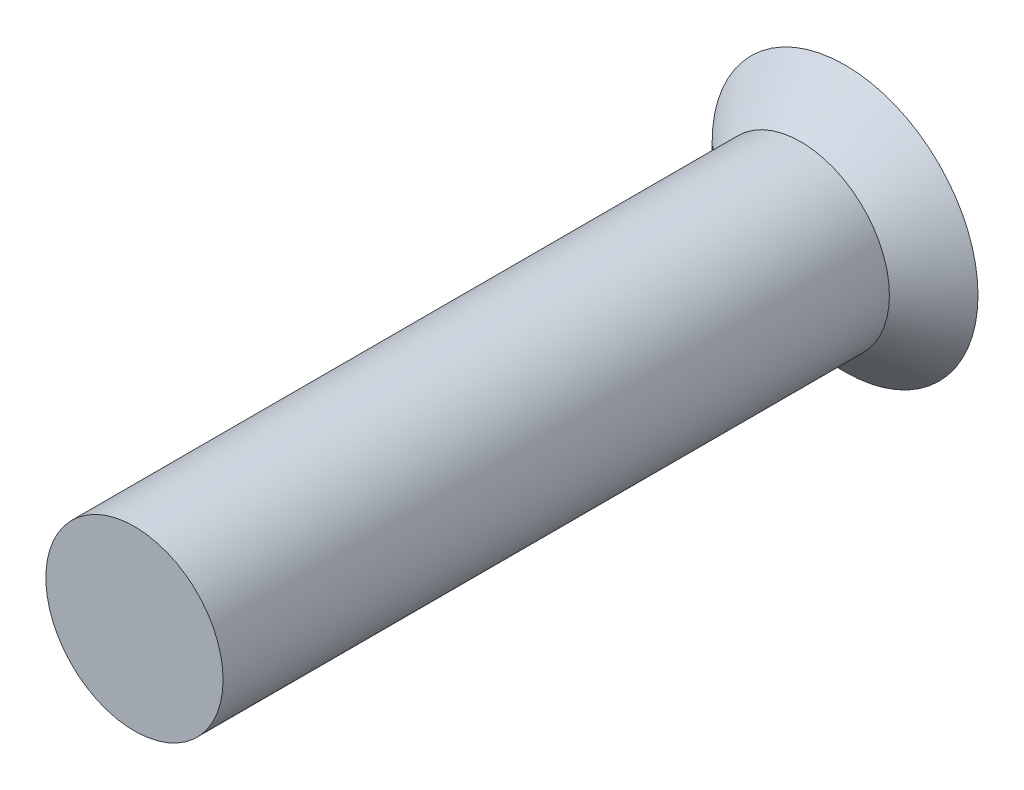
ISO-10303-21;
HEADER;
FILE_DESCRIPTION(('STEP AP214'),'2;1');
FILE_NAME('part.step','',(''),(''),'','','');
FILE_SCHEMA(('AUTOMOTIVE_DESIGN { 1 0 10303 214 1 1 1 1 }'));
ENDSEC;
DATA;
#1=APPLICATION_CONTEXT('core data for automotive mechanical design processes');
#2=APPLICATION_PROTOCOL_DEFINITION('international standard','automotive_design',2000,#1);
#3=PRODUCT_CONTEXT('',#1,'mechanical');
#4=PRODUCT('Part','Part','',(#3));
#5=PRODUCT_RELATED_PRODUCT_CATEGORY('part','',(#4));
#6=PRODUCT_DEFINITION_FORMATION('','',#4);
#7=PRODUCT_DEFINITION_CONTEXT('part definition',#1,'design');
#8=PRODUCT_DEFINITION('design','',#6,#7);
#9=PRODUCT_DEFINITION_SHAPE('','',#8);
#10=(LENGTH_UNIT() NAMED_UNIT(*) SI_UNIT(.MILLI.,.METRE.));
#11=(NAMED_UNIT(*) PLANE_ANGLE_UNIT() SI_UNIT($,.RADIAN.));
#12=(NAMED_UNIT(*) SI_UNIT($,.STERADIAN.) SOLID_ANGLE_UNIT());
#13=UNCERTAINTY_MEASURE_WITH_UNIT(LENGTH_MEASURE(1.E-05),#10,'distance_accuracy_value','');
#14=(GEOMETRIC_REPRESENTATION_CONTEXT(3) GLOBAL_UNCERTAINTY_ASSIGNED_CONTEXT((#13)) GLOBAL_UNIT_ASSIGNED_CONTEXT((#10,
#11,#12)) REPRESENTATION_CONTEXT('',''));
#15=CARTESIAN_POINT('',(0.,0.,0.));
#16=DIRECTION('',(0.,0.,1.));
#17=DIRECTION('',(1.,0.,0.));
#18=AXIS2_PLACEMENT_3D('',#15,#16,#17);
#19=CARTESIAN_POINT('',(0.,0.,1.88));
#20=DIRECTION('',(0.,0.,-1.));
#21=DIRECTION('',(-1.,0.,0.));
#22=AXIS2_PLACEMENT_3D('',#19,#20,#21);
#23=CYLINDRICAL_SURFACE('',#22,0.5);
#24=CARTESIAN_POINT('',(0.,0.,1.88));
#25=DIRECTION('',(0.,0.,1.));
#26=DIRECTION('',(1.,0.,0.));
#27=AXIS2_PLACEMENT_3D('',#24,#25,#26);
#28=CIRCLE('',#27,0.5);
#29=CARTESIAN_POINT('',(0.5,0.,1.88));
#30=VERTEX_POINT('',#29);
#31=EDGE_CURVE('E11',#30,#30,#28,.T.);
#32=ORIENTED_EDGE('',*,*,#31,.F.);
#33=EDGE_LOOP('',(#32));
#34=FACE_BOUND('',#33,.T.);
#35=CARTESIAN_POINT('',(0.,0.,-1.88));
#36=DIRECTION('',(0.,0.,1.));
#37=DIRECTION('',(1.,0.,0.));
#38=AXIS2_PLACEMENT_3D('',#35,#36,#37);
#39=CIRCLE('',#38,0.5);
#40=CARTESIAN_POINT('',(0.5,0.,-1.88));
#41=VERTEX_POINT('',#40);
#42=EDGE_CURVE('E189',#41,#41,#39,.T.);
#43=ORIENTED_EDGE('',*,*,#42,.T.);
#44=EDGE_LOOP('',(#43));
#45=FACE_BOUND('',#44,.T.);
#46=ADVANCED_FACE('F34',(#34,#45),#23,.T.);
#47=CARTESIAN_POINT('',(0.,0.,1.88));
#48=DIRECTION('',(0.,0.,1.));
#49=DIRECTION('',(1.,0.,0.));
#50=AXIS2_PLACEMENT_3D('',#47,#48,#49);
#51=PLANE('',#50);
#52=ORIENTED_EDGE('',*,*,#31,.T.);
#53=EDGE_LOOP('',(#52));
#54=FACE_BOUND('',#53,.T.);
#55=ADVANCED_FACE('F215',(#54),#51,.T.);
#56=CARTESIAN_POINT('',(0.,0.750000000000001,-2.13));
#57=DIRECTION('',(0.,0.,1.));
#58=DIRECTION('',(1.,0.,0.));
#59=AXIS2_PLACEMENT_3D('',#56,#57,#58);
#60=PLANE('',#59);
#61=DIRECTION('',(0.,-1.,0.));
#62=VECTOR('',#61,1.);
#63=CARTESIAN_POINT('',(0.1,0.6,-2.13));
#64=LINE('',#63,#62);
#65=CARTESIAN_POINT('',(0.1,0.6,-2.13));
#66=VERTEX_POINT('',#65);
#67=CARTESIAN_POINT('',(0.1,0.1,-2.13));
#68=VERTEX_POINT('',#67);
#69=EDGE_CURVE('E158',#66,#68,#64,.T.);
#70=ORIENTED_EDGE('',*,*,#69,.F.);
#71=DIRECTION('',(1.,0.,0.));
#72=VECTOR('',#71,1.);
#73=CARTESIAN_POINT('',(-0.1,0.6,-2.13));
#74=LINE('',#73,#72);
#75=CARTESIAN_POINT('',(-0.1,0.6,-2.13));
#76=VERTEX_POINT('',#75);
#77=EDGE_CURVE('E48',#76,#66,#74,.T.);
#78=ORIENTED_EDGE('',*,*,#77,.F.);
#79=DIRECTION('',(0.,1.,0.));
#80=VECTOR('',#79,1.);
#81=CARTESIAN_POINT('',(-0.1,0.1,-2.13));
#82=LINE('',#81,#80);
#83=CARTESIAN_POINT('',(-0.1,0.1,-2.13));
#84=VERTEX_POINT('',#83);
#85=EDGE_CURVE('E185',#84,#76,#82,.T.);
#86=ORIENTED_EDGE('',*,*,#85,.F.);
#87=DIRECTION('',(1.,0.,0.));
#88=VECTOR('',#87,1.);
#89=CARTESIAN_POINT('',(-0.6,0.1,-2.13));
#90=LINE('',#89,#88);
#91=CARTESIAN_POINT('',(-0.6,0.1,-2.13));
#92=VERTEX_POINT('',#91);
#93=EDGE_CURVE('E183',#92,#84,#90,.T.);
#94=ORIENTED_EDGE('',*,*,#93,.F.);
#95=DIRECTION('',(0.,1.,0.));
#96=VECTOR('',#95,1.);
#97=CARTESIAN_POINT('',(-0.6,-0.1,-2.13));
#98=LINE('',#97,#96);
#99=CARTESIAN_POINT('',(-0.6,-0.1,-2.13));
#100=VERTEX_POINT('',#99);
#101=EDGE_CURVE('E132',#100,#92,#98,.T.);
#102=ORIENTED_EDGE('',*,*,#101,.F.);
#103=DIRECTION('',(-1.,0.,0.));
#104=VECTOR('',#103,1.);
#105=CARTESIAN_POINT('',(-0.0999999999999999,-0.1,-2.13));
#106=LINE('',#105,#104);
#107=CARTESIAN_POINT('',(-0.0999999999999999,-0.1,-2.13));
#108=VERTEX_POINT('',#107);
#109=EDGE_CURVE('E179',#108,#100,#106,.T.);
#110=ORIENTED_EDGE('',*,*,#109,.F.);
#111=DIRECTION('',(0.,1.,0.));
#112=VECTOR('',#111,1.);
#113=CARTESIAN_POINT('',(-0.1,-0.6,-2.13));
#114=LINE('',#113,#112);
#115=CARTESIAN_POINT('',(-0.1,-0.6,-2.13));
#116=VERTEX_POINT('',#115);
#117=EDGE_CURVE('E176',#116,#108,#114,.T.);
#118=ORIENTED_EDGE('',*,*,#117,.F.);
#119=DIRECTION('',(-1.,0.,0.));
#120=VECTOR('',#119,1.);
#121=CARTESIAN_POINT('',(0.0999999999999999,-0.6,-2.13));
#122=LINE('',#121,#120);
#123=CARTESIAN_POINT('',(0.0999999999999999,-0.6,-2.13));
#124=VERTEX_POINT('',#123);
#125=EDGE_CURVE('E173',#124,#116,#122,.T.);
#126=ORIENTED_EDGE('',*,*,#125,.F.);
#127=DIRECTION('',(0.,-1.,0.));
#128=VECTOR('',#127,1.);
#129=CARTESIAN_POINT('',(0.1,-0.1,-2.13));
#130=LINE('',#129,#128);
#131=CARTESIAN_POINT('',(0.1,-0.1,-2.13));
#132=VERTEX_POINT('',#131);
#133=EDGE_CURVE('E170',#132,#124,#130,.T.);
#134=ORIENTED_EDGE('',*,*,#133,.F.);
#135=DIRECTION('',(-1.,0.,0.));
#136=VECTOR('',#135,1.);
#137=CARTESIAN_POINT('',(0.6,-0.1,-2.13));
#138=LINE('',#137,#136);
#139=CARTESIAN_POINT('',(0.6,-0.1,-2.13));
#140=VERTEX_POINT('',#139);
#141=EDGE_CURVE('E167',#140,#132,#138,.T.);
#142=ORIENTED_EDGE('',*,*,#141,.F.);
#143=DIRECTION('',(0.,-1.,0.));
#144=VECTOR('',#143,1.);
#145=CARTESIAN_POINT('',(0.6,0.1,-2.13));
#146=LINE('',#145,#144);
#147=CARTESIAN_POINT('',(0.6,0.1,-2.13));
#148=VERTEX_POINT('',#147);
#149=EDGE_CURVE('E164',#148,#140,#146,.T.);
#150=ORIENTED_EDGE('',*,*,#149,.F.);
#151=DIRECTION('',(1.,0.,0.));
#152=VECTOR('',#151,1.);
#153=CARTESIAN_POINT('',(0.1,0.1,-2.13));
#154=LINE('',#153,#152);
#155=EDGE_CURVE('E161',#68,#148,#154,.T.);
#156=ORIENTED_EDGE('',*,*,#155,.F.);
#157=EDGE_LOOP('',(#70,#78,#86,#94,#102,#110,#118,#126,#134,#142,#150,#156));
#158=FACE_BOUND('',#157,.T.);
#159=CARTESIAN_POINT('',(0.,0.,-2.13));
#160=DIRECTION('',(0.,0.,1.));
#161=DIRECTION('',(1.,0.,0.));
#162=AXIS2_PLACEMENT_3D('',#159,#160,#161);
#163=CIRCLE('',#162,0.750000000000001);
#164=CARTESIAN_POINT('',(0.750000000000001,0.,-2.13));
#165=VERTEX_POINT('',#164);
#166=EDGE_CURVE('E41',#165,#165,#163,.T.);
#167=ORIENTED_EDGE('',*,*,#166,.F.);
#168=EDGE_LOOP('',(#167));
#169=FACE_BOUND('',#168,.T.);
#170=ADVANCED_FACE('F213',(#158,#169),#60,.F.);
#171=CARTESIAN_POINT('',(0.,0.,-2.13));
#172=DIRECTION('',(0.,0.,-1.));
#173=DIRECTION('',(-1.,0.,0.));
#174=AXIS2_PLACEMENT_3D('',#171,#172,#173);
#175=CONICAL_SURFACE('',#174,0.750000000000001,0.78539816339745);
#176=ORIENTED_EDGE('',*,*,#42,.F.);
#177=EDGE_LOOP('',(#176));
#178=FACE_BOUND('',#177,.T.);
#179=ORIENTED_EDGE('',*,*,#166,.T.);
#180=EDGE_LOOP('',(#179));
#181=FACE_BOUND('',#180,.T.);
#182=ADVANCED_FACE('F211',(#178,#181),#175,.T.);
#183=CARTESIAN_POINT('',(-0.1,0.6,-2.03));
#184=DIRECTION('',(0.,1.,0.));
#185=DIRECTION('',(0.,0.,1.));
#186=AXIS2_PLACEMENT_3D('',#183,#184,#185);
#187=PLANE('',#186);
#188=ORIENTED_EDGE('',*,*,#77,.T.);
#189=DIRECTION('',(0.,0.,-1.));
#190=VECTOR('',#189,1.);
#191=CARTESIAN_POINT('',(0.1,0.6,-2.03));
#192=LINE('',#191,#190);
#193=CARTESIAN_POINT('',(0.1,0.6,-2.03));
#194=VERTEX_POINT('',#193);
#195=EDGE_CURVE('E96',#194,#66,#192,.T.);
#196=ORIENTED_EDGE('',*,*,#195,.F.);
#197=DIRECTION('',(1.,0.,0.));
#198=VECTOR('',#197,1.);
#199=CARTESIAN_POINT('',(-0.1,0.6,-2.03));
#200=LINE('',#199,#198);
#201=CARTESIAN_POINT('',(-0.1,0.6,-2.03));
#202=VERTEX_POINT('',#201);
#203=EDGE_CURVE('E187',#202,#194,#200,.T.);
#204=ORIENTED_EDGE('',*,*,#203,.F.);
#205=DIRECTION('',(0.,0.,-1.));
#206=VECTOR('',#205,1.);
#207=CARTESIAN_POINT('',(-0.1,0.6,-2.03));
#208=LINE('',#207,#206);
#209=EDGE_CURVE('E56',#202,#76,#208,.T.);
#210=ORIENTED_EDGE('',*,*,#209,.T.);
#211=EDGE_LOOP('',(#188,#196,#204,#210));
#212=FACE_BOUND('',#211,.T.);
#213=ADVANCED_FACE('F222',(#212),#187,.F.);
#214=CARTESIAN_POINT('',(-0.1,0.1,-2.03));
#215=DIRECTION('',(-1.,0.,0.));
#216=DIRECTION('',(0.,-1.,0.));
#217=AXIS2_PLACEMENT_3D('',#214,#215,#216);
#218=PLANE('',#217);
#219=ORIENTED_EDGE('',*,*,#85,.T.);
#220=ORIENTED_EDGE('',*,*,#209,.F.);
#221=DIRECTION('',(0.,1.,0.));
#222=VECTOR('',#221,1.);
#223=CARTESIAN_POINT('',(-0.1,0.1,-2.03));
#224=LINE('',#223,#222);
#225=CARTESIAN_POINT('',(-0.1,0.1,-2.03));
#226=VERTEX_POINT('',#225);
#227=EDGE_CURVE('E144',#226,#202,#224,.T.);
#228=ORIENTED_EDGE('',*,*,#227,.F.);
#229=DIRECTION('',(0.,0.,-1.));
#230=VECTOR('',#229,1.);
#231=CARTESIAN_POINT('',(-0.1,0.1,-2.03));
#232=LINE('',#231,#230);
#233=EDGE_CURVE('E136',#226,#84,#232,.T.);
#234=ORIENTED_EDGE('',*,*,#233,.T.);
#235=EDGE_LOOP('',(#219,#220,#228,#234));
#236=FACE_BOUND('',#235,.T.);
#237=ADVANCED_FACE('F257',(#236),#218,.F.);
#238=CARTESIAN_POINT('',(-0.6,0.1,-2.03));
#239=DIRECTION('',(0.,1.,0.));
#240=DIRECTION('',(0.,0.,1.));
#241=AXIS2_PLACEMENT_3D('',#238,#239,#240);
#242=PLANE('',#241);
#243=ORIENTED_EDGE('',*,*,#93,.T.);
#244=ORIENTED_EDGE('',*,*,#233,.F.);
#245=DIRECTION('',(1.,0.,0.));
#246=VECTOR('',#245,1.);
#247=CARTESIAN_POINT('',(-0.6,0.1,-2.03));
#248=LINE('',#247,#246);
#249=CARTESIAN_POINT('',(-0.6,0.1,-2.03));
#250=VERTEX_POINT('',#249);
#251=EDGE_CURVE('E140',#250,#226,#248,.T.);
#252=ORIENTED_EDGE('',*,*,#251,.F.);
#253=DIRECTION('',(0.,0.,-1.));
#254=VECTOR('',#253,1.);
#255=CARTESIAN_POINT('',(-0.6,0.1,-2.03));
#256=LINE('',#255,#254);
#257=EDGE_CURVE('E125',#250,#92,#256,.T.);
#258=ORIENTED_EDGE('',*,*,#257,.T.);
#259=EDGE_LOOP('',(#243,#244,#252,#258));
#260=FACE_BOUND('',#259,.T.);
#261=ADVANCED_FACE('F141',(#260),#242,.F.);
#262=CARTESIAN_POINT('',(-0.6,-0.1,-2.03));
#263=DIRECTION('',(-1.,0.,0.));
#264=DIRECTION('',(0.,-1.,0.));
#265=AXIS2_PLACEMENT_3D('',#262,#263,#264);
#266=PLANE('',#265);
#267=ORIENTED_EDGE('',*,*,#101,.T.);
#268=ORIENTED_EDGE('',*,*,#257,.F.);
#269=DIRECTION('',(0.,1.,0.));
#270=VECTOR('',#269,1.);
#271=CARTESIAN_POINT('',(-0.6,-0.1,-2.03));
#272=LINE('',#271,#270);
#273=CARTESIAN_POINT('',(-0.6,-0.1,-2.03));
#274=VERTEX_POINT('',#273);
#275=EDGE_CURVE('E129',#274,#250,#272,.T.);
#276=ORIENTED_EDGE('',*,*,#275,.F.);
#277=DIRECTION('',(0.,0.,-1.));
#278=VECTOR('',#277,1.);
#279=CARTESIAN_POINT('',(-0.6,-0.1,-2.03));
#280=LINE('',#279,#278);
#281=EDGE_CURVE('E137',#274,#100,#280,.T.);
#282=ORIENTED_EDGE('',*,*,#281,.T.);
#283=EDGE_LOOP('',(#267,#268,#276,#282));
#284=FACE_BOUND('',#283,.T.);
#285=ADVANCED_FACE('F127',(#284),#266,.F.);
#286=CARTESIAN_POINT('',(-0.0999999999999999,-0.1,-2.03));
#287=DIRECTION('',(0.,-1.,0.));
#288=DIRECTION('',(0.,0.,-1.));
#289=AXIS2_PLACEMENT_3D('',#286,#287,#288);
#290=PLANE('',#289);
#291=ORIENTED_EDGE('',*,*,#109,.T.);
#292=ORIENTED_EDGE('',*,*,#281,.F.);
#293=DIRECTION('',(-1.,0.,0.));
#294=VECTOR('',#293,1.);
#295=CARTESIAN_POINT('',(-0.0999999999999999,-0.1,-2.03));
#296=LINE('',#295,#294);
#297=CARTESIAN_POINT('',(-0.0999999999999999,-0.1,-2.03));
#298=VERTEX_POINT('',#297);
#299=EDGE_CURVE('E150',#298,#274,#296,.T.);
#300=ORIENTED_EDGE('',*,*,#299,.F.);
#301=DIRECTION('',(0.,0.,-1.));
#302=VECTOR('',#301,1.);
#303=CARTESIAN_POINT('',(-0.0999999999999999,-0.1,-2.03));
#304=LINE('',#303,#302);
#305=EDGE_CURVE('E192',#298,#108,#304,.T.);
#306=ORIENTED_EDGE('',*,*,#305,.T.);
#307=EDGE_LOOP('',(#291,#292,#300,#306));
#308=FACE_BOUND('',#307,.T.);
#309=ADVANCED_FACE('F282',(#308),#290,.F.);
#310=CARTESIAN_POINT('',(-0.1,-0.6,-2.03));
#311=DIRECTION('',(-1.,0.,0.));
#312=DIRECTION('',(0.,-1.,0.));
#313=AXIS2_PLACEMENT_3D('',#310,#311,#312);
#314=PLANE('',#313);
#315=ORIENTED_EDGE('',*,*,#117,.T.);
#316=ORIENTED_EDGE('',*,*,#305,.F.);
#317=DIRECTION('',(0.,1.,0.));
#318=VECTOR('',#317,1.);
#319=CARTESIAN_POINT('',(-0.1,-0.6,-2.03));
#320=LINE('',#319,#318);
#321=CARTESIAN_POINT('',(-0.1,-0.6,-2.03));
#322=VERTEX_POINT('',#321);
#323=EDGE_CURVE('E152',#322,#298,#320,.T.);
#324=ORIENTED_EDGE('',*,*,#323,.F.);
#325=DIRECTION('',(0.,0.,-1.));
#326=VECTOR('',#325,1.);
#327=CARTESIAN_POINT('',(-0.1,-0.6,-2.03));
#328=LINE('',#327,#326);
#329=EDGE_CURVE('E194',#322,#116,#328,.T.);
#330=ORIENTED_EDGE('',*,*,#329,.T.);
#331=EDGE_LOOP('',(#315,#316,#324,#330));
#332=FACE_BOUND('',#331,.T.);
#333=ADVANCED_FACE('F291',(#332),#314,.F.);
#334=CARTESIAN_POINT('',(0.0999999999999999,-0.6,-2.03));
#335=DIRECTION('',(0.,-1.,0.));
#336=DIRECTION('',(1.,0.,0.));
#337=AXIS2_PLACEMENT_3D('',#334,#335,#336);
#338=PLANE('',#337);
#339=ORIENTED_EDGE('',*,*,#125,.T.);
#340=ORIENTED_EDGE('',*,*,#329,.F.);
#341=DIRECTION('',(-1.,0.,0.));
#342=VECTOR('',#341,1.);
#343=CARTESIAN_POINT('',(0.0999999999999999,-0.6,-2.03));
#344=LINE('',#343,#342);
#345=CARTESIAN_POINT('',(0.0999999999999999,-0.6,-2.03));
#346=VERTEX_POINT('',#345);
#347=EDGE_CURVE('E395',#346,#322,#344,.T.);
#348=ORIENTED_EDGE('',*,*,#347,.F.);
#349=DIRECTION('',(0.,0.,-1.));
#350=VECTOR('',#349,1.);
#351=CARTESIAN_POINT('',(0.0999999999999999,-0.6,-2.03));
#352=LINE('',#351,#350);
#353=EDGE_CURVE('E196',#346,#124,#352,.T.);
#354=ORIENTED_EDGE('',*,*,#353,.T.);
#355=EDGE_LOOP('',(#339,#340,#348,#354));
#356=FACE_BOUND('',#355,.T.);
#357=ADVANCED_FACE('F301',(#356),#338,.F.);
#358=CARTESIAN_POINT('',(0.1,-0.1,-2.03));
#359=DIRECTION('',(1.,0.,0.));
#360=DIRECTION('',(0.,1.,0.));
#361=AXIS2_PLACEMENT_3D('',#358,#359,#360);
#362=PLANE('',#361);
#363=ORIENTED_EDGE('',*,*,#133,.T.);
#364=ORIENTED_EDGE('',*,*,#353,.F.);
#365=DIRECTION('',(0.,-1.,0.));
#366=VECTOR('',#365,1.);
#367=CARTESIAN_POINT('',(0.1,-0.1,-2.03));
#368=LINE('',#367,#366);
#369=CARTESIAN_POINT('',(0.1,-0.1,-2.03));
#370=VERTEX_POINT('',#369);
#371=EDGE_CURVE('E392',#370,#346,#368,.T.);
#372=ORIENTED_EDGE('',*,*,#371,.F.);
#373=DIRECTION('',(0.,0.,-1.));
#374=VECTOR('',#373,1.);
#375=CARTESIAN_POINT('',(0.1,-0.1,-2.03));
#376=LINE('',#375,#374);
#377=EDGE_CURVE('E198',#370,#132,#376,.T.);
#378=ORIENTED_EDGE('',*,*,#377,.T.);
#379=EDGE_LOOP('',(#363,#364,#372,#378));
#380=FACE_BOUND('',#379,.T.);
#381=ADVANCED_FACE('F311',(#380),#362,.F.);
#382=CARTESIAN_POINT('',(0.6,-0.1,-2.03));
#383=DIRECTION('',(0.,-1.,0.));
#384=DIRECTION('',(0.,0.,-1.));
#385=AXIS2_PLACEMENT_3D('',#382,#383,#384);
#386=PLANE('',#385);
#387=ORIENTED_EDGE('',*,*,#141,.T.);
#388=ORIENTED_EDGE('',*,*,#377,.F.);
#389=DIRECTION('',(-1.,0.,0.));
#390=VECTOR('',#389,1.);
#391=CARTESIAN_POINT('',(0.6,-0.1,-2.03));
#392=LINE('',#391,#390);
#393=CARTESIAN_POINT('',(0.6,-0.1,-2.03));
#394=VERTEX_POINT('',#393);
#395=EDGE_CURVE('E389',#394,#370,#392,.T.);
#396=ORIENTED_EDGE('',*,*,#395,.F.);
#397=DIRECTION('',(0.,0.,-1.));
#398=VECTOR('',#397,1.);
#399=CARTESIAN_POINT('',(0.6,-0.1,-2.03));
#400=LINE('',#399,#398);
#401=EDGE_CURVE('E200',#394,#140,#400,.T.);
#402=ORIENTED_EDGE('',*,*,#401,.T.);
#403=EDGE_LOOP('',(#387,#388,#396,#402));
#404=FACE_BOUND('',#403,.T.);
#405=ADVANCED_FACE('F321',(#404),#386,.F.);
#406=CARTESIAN_POINT('',(0.6,0.1,-2.03));
#407=DIRECTION('',(1.,0.,0.));
#408=DIRECTION('',(0.,1.,0.));
#409=AXIS2_PLACEMENT_3D('',#406,#407,#408);
#410=PLANE('',#409);
#411=ORIENTED_EDGE('',*,*,#149,.T.);
#412=ORIENTED_EDGE('',*,*,#401,.F.);
#413=DIRECTION('',(0.,-1.,0.));
#414=VECTOR('',#413,1.);
#415=CARTESIAN_POINT('',(0.6,0.1,-2.03));
#416=LINE('',#415,#414);
#417=CARTESIAN_POINT('',(0.6,0.1,-2.03));
#418=VERTEX_POINT('',#417);
#419=EDGE_CURVE('E382',#418,#394,#416,.T.);
#420=ORIENTED_EDGE('',*,*,#419,.F.);
#421=DIRECTION('',(0.,0.,-1.));
#422=VECTOR('',#421,1.);
#423=CARTESIAN_POINT('',(0.6,0.1,-2.03));
#424=LINE('',#423,#422);
#425=EDGE_CURVE('E202',#418,#148,#424,.T.);
#426=ORIENTED_EDGE('',*,*,#425,.T.);
#427=EDGE_LOOP('',(#411,#412,#420,#426));
#428=FACE_BOUND('',#427,.T.);
#429=ADVANCED_FACE('F331',(#428),#410,.F.);
#430=CARTESIAN_POINT('',(0.1,0.1,-2.03));
#431=DIRECTION('',(0.,1.,0.));
#432=DIRECTION('',(0.,0.,1.));
#433=AXIS2_PLACEMENT_3D('',#430,#431,#432);
#434=PLANE('',#433);
#435=ORIENTED_EDGE('',*,*,#155,.T.);
#436=ORIENTED_EDGE('',*,*,#425,.F.);
#437=DIRECTION('',(1.,0.,0.));
#438=VECTOR('',#437,1.);
#439=CARTESIAN_POINT('',(0.1,0.1,-2.03));
#440=LINE('',#439,#438);
#441=CARTESIAN_POINT('',(0.1,0.1,-2.03));
#442=VERTEX_POINT('',#441);
#443=EDGE_CURVE('E379',#442,#418,#440,.T.);
#444=ORIENTED_EDGE('',*,*,#443,.F.);
#445=DIRECTION('',(0.,0.,-1.));
#446=VECTOR('',#445,1.);
#447=CARTESIAN_POINT('',(0.1,0.1,-2.03));
#448=LINE('',#447,#446);
#449=EDGE_CURVE('E204',#442,#68,#448,.T.);
#450=ORIENTED_EDGE('',*,*,#449,.T.);
#451=EDGE_LOOP('',(#435,#436,#444,#450));
#452=FACE_BOUND('',#451,.T.);
#453=ADVANCED_FACE('F341',(#452),#434,.F.);
#454=CARTESIAN_POINT('',(0.1,0.6,-2.03));
#455=DIRECTION('',(1.,0.,0.));
#456=DIRECTION('',(0.,1.,0.));
#457=AXIS2_PLACEMENT_3D('',#454,#455,#456);
#458=PLANE('',#457);
#459=ORIENTED_EDGE('',*,*,#69,.T.);
#460=ORIENTED_EDGE('',*,*,#449,.F.);
#461=DIRECTION('',(0.,-1.,0.));
#462=VECTOR('',#461,1.);
#463=CARTESIAN_POINT('',(0.1,0.6,-2.03));
#464=LINE('',#463,#462);
#465=EDGE_CURVE('E383',#194,#442,#464,.T.);
#466=ORIENTED_EDGE('',*,*,#465,.F.);
#467=ORIENTED_EDGE('',*,*,#195,.T.);
#468=EDGE_LOOP('',(#459,#460,#466,#467));
#469=FACE_BOUND('',#468,.T.);
#470=ADVANCED_FACE('F351',(#469),#458,.F.);
#471=CARTESIAN_POINT('',(0.,0.,-2.03));
#472=DIRECTION('',(0.,0.,-1.));
#473=DIRECTION('',(-1.,0.,0.));
#474=AXIS2_PLACEMENT_3D('',#471,#472,#473);
#475=PLANE('',#474);
#476=ORIENTED_EDGE('',*,*,#203,.T.);
#477=ORIENTED_EDGE('',*,*,#465,.T.);
#478=ORIENTED_EDGE('',*,*,#443,.T.);
#479=ORIENTED_EDGE('',*,*,#419,.T.);
#480=ORIENTED_EDGE('',*,*,#395,.T.);
#481=ORIENTED_EDGE('',*,*,#371,.T.);
#482=ORIENTED_EDGE('',*,*,#347,.T.);
#483=ORIENTED_EDGE('',*,*,#323,.T.);
#484=ORIENTED_EDGE('',*,*,#299,.T.);
#485=ORIENTED_EDGE('',*,*,#275,.T.);
#486=ORIENTED_EDGE('',*,*,#251,.T.);
#487=ORIENTED_EDGE('',*,*,#227,.T.);
#488=EDGE_LOOP('',(#476,#477,#478,#479,#480,#481,#482,#483,#484,#485,#486,#487));
#489=FACE_BOUND('',#488,.T.);
#490=ADVANCED_FACE('F147',(#489),#475,.T.);
#491=CLOSED_SHELL('',(#46,#55,#170,#182,#213,#237,#261,#285,#309,#333,#357,#381,#405,#429,#453,
#470,#490));
#492=MANIFOLD_SOLID_BREP('B2',#491);
#493=ADVANCED_BREP_SHAPE_REPRESENTATION('',(#18,#492),#14);
#494=SHAPE_DEFINITION_REPRESENTATION(#9,#493);
ENDSEC;
END-ISO-10303-21;
